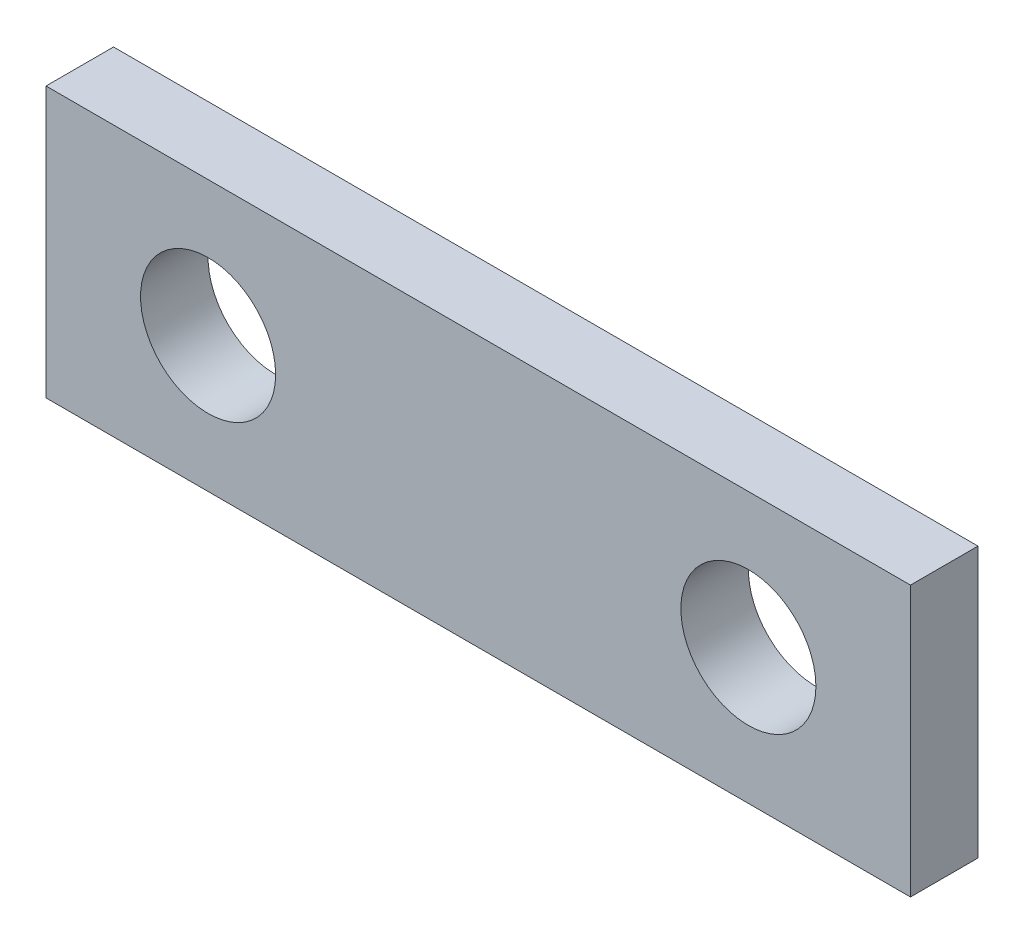
ISO-10303-21;
HEADER;
FILE_DESCRIPTION(('STEP AP214'),'2;1');
FILE_NAME('part.step','',(''),(''),'','','');
FILE_SCHEMA(('AUTOMOTIVE_DESIGN { 1 0 10303 214 1 1 1 1 }'));
ENDSEC;
DATA;
#1=APPLICATION_CONTEXT('core data for automotive mechanical design processes');
#2=APPLICATION_PROTOCOL_DEFINITION('international standard','automotive_design',2000,#1);
#3=PRODUCT_CONTEXT('',#1,'mechanical');
#4=PRODUCT('Part','Part','',(#3));
#5=PRODUCT_RELATED_PRODUCT_CATEGORY('part','',(#4));
#6=PRODUCT_DEFINITION_FORMATION('','',#4);
#7=PRODUCT_DEFINITION_CONTEXT('part definition',#1,'design');
#8=PRODUCT_DEFINITION('design','',#6,#7);
#9=PRODUCT_DEFINITION_SHAPE('','',#8);
#10=(LENGTH_UNIT() NAMED_UNIT(*) SI_UNIT(.MILLI.,.METRE.));
#11=(NAMED_UNIT(*) PLANE_ANGLE_UNIT() SI_UNIT($,.RADIAN.));
#12=(NAMED_UNIT(*) SI_UNIT($,.STERADIAN.) SOLID_ANGLE_UNIT());
#13=UNCERTAINTY_MEASURE_WITH_UNIT(LENGTH_MEASURE(1.E-05),#10,'distance_accuracy_value','');
#14=(GEOMETRIC_REPRESENTATION_CONTEXT(3) GLOBAL_UNCERTAINTY_ASSIGNED_CONTEXT((#13)) GLOBAL_UNIT_ASSIGNED_CONTEXT((#10,
#11,#12)) REPRESENTATION_CONTEXT('',''));
#15=CARTESIAN_POINT('',(0.,0.,0.));
#16=DIRECTION('',(0.,0.,1.));
#17=DIRECTION('',(1.,0.,0.));
#18=AXIS2_PLACEMENT_3D('',#15,#16,#17);
#19=CARTESIAN_POINT('',(0.,0.,1.5875));
#20=DIRECTION('',(0.,0.,-1.));
#21=DIRECTION('',(-1.,0.,0.));
#22=AXIS2_PLACEMENT_3D('',#19,#20,#21);
#23=PLANE('',#22);
#24=DIRECTION('',(0.,-1.,0.));
#25=VECTOR('',#24,1.);
#26=CARTESIAN_POINT('',(0.,0.,1.5875));
#27=LINE('',#26,#25);
#28=CARTESIAN_POINT('',(0.,6.35,1.5875));
#29=VERTEX_POINT('',#28);
#30=CARTESIAN_POINT('',(0.,0.,1.5875));
#31=VERTEX_POINT('',#30);
#32=EDGE_CURVE('E87',#29,#31,#27,.T.);
#33=ORIENTED_EDGE('',*,*,#32,.T.);
#34=DIRECTION('',(1.,0.,0.));
#35=VECTOR('',#34,1.);
#36=CARTESIAN_POINT('',(0.,0.,1.5875));
#37=LINE('',#36,#35);
#38=CARTESIAN_POINT('',(20.32,0.,1.5875));
#39=VERTEX_POINT('',#38);
#40=EDGE_CURVE('E82',#31,#39,#37,.T.);
#41=ORIENTED_EDGE('',*,*,#40,.T.);
#42=DIRECTION('',(0.,1.,0.));
#43=VECTOR('',#42,1.);
#44=CARTESIAN_POINT('',(20.32,0.,1.5875));
#45=LINE('',#44,#43);
#46=CARTESIAN_POINT('',(20.32,6.35,1.5875));
#47=VERTEX_POINT('',#46);
#48=EDGE_CURVE('E85',#39,#47,#45,.T.);
#49=ORIENTED_EDGE('',*,*,#48,.T.);
#50=DIRECTION('',(-1.,0.,0.));
#51=VECTOR('',#50,1.);
#52=CARTESIAN_POINT('',(0.,6.35,1.5875));
#53=LINE('',#52,#51);
#54=EDGE_CURVE('E52',#47,#29,#53,.T.);
#55=ORIENTED_EDGE('',*,*,#54,.T.);
#56=EDGE_LOOP('',(#33,#41,#49,#55));
#57=FACE_BOUND('',#56,.T.);
#58=CARTESIAN_POINT('',(3.81,3.175,1.5875));
#59=DIRECTION('',(0.,0.,1.));
#60=DIRECTION('',(1.,0.,0.));
#61=AXIS2_PLACEMENT_3D('',#58,#59,#60);
#62=CIRCLE('',#61,1.5875);
#63=CARTESIAN_POINT('',(5.3975,3.175,1.5875));
#64=VERTEX_POINT('',#63);
#65=EDGE_CURVE('E102',#64,#64,#62,.T.);
#66=ORIENTED_EDGE('',*,*,#65,.F.);
#67=EDGE_LOOP('',(#66));
#68=FACE_BOUND('',#67,.T.);
#69=CARTESIAN_POINT('',(16.51,3.175,1.5875));
#70=DIRECTION('',(0.,0.,1.));
#71=DIRECTION('',(1.,0.,0.));
#72=AXIS2_PLACEMENT_3D('',#69,#70,#71);
#73=CIRCLE('',#72,1.5875);
#74=CARTESIAN_POINT('',(18.0975,3.175,1.5875));
#75=VERTEX_POINT('',#74);
#76=EDGE_CURVE('E117',#75,#75,#73,.T.);
#77=ORIENTED_EDGE('',*,*,#76,.F.);
#78=EDGE_LOOP('',(#77));
#79=FACE_BOUND('',#78,.T.);
#80=ADVANCED_FACE('F35',(#57,#68,#79),#23,.F.);
#81=CARTESIAN_POINT('',(0.,0.,0.));
#82=DIRECTION('',(0.,0.,-1.));
#83=DIRECTION('',(-1.,0.,0.));
#84=AXIS2_PLACEMENT_3D('',#81,#82,#83);
#85=PLANE('',#84);
#86=CARTESIAN_POINT('',(3.81,3.175,0.));
#87=DIRECTION('',(0.,0.,1.));
#88=DIRECTION('',(1.,0.,0.));
#89=AXIS2_PLACEMENT_3D('',#86,#87,#88);
#90=CIRCLE('',#89,1.5875);
#91=CARTESIAN_POINT('',(5.3975,3.175,0.));
#92=VERTEX_POINT('',#91);
#93=EDGE_CURVE('E114',#92,#92,#90,.T.);
#94=ORIENTED_EDGE('',*,*,#93,.T.);
#95=EDGE_LOOP('',(#94));
#96=FACE_BOUND('',#95,.T.);
#97=DIRECTION('',(0.,-1.,0.));
#98=VECTOR('',#97,1.);
#99=CARTESIAN_POINT('',(0.,0.,0.));
#100=LINE('',#99,#98);
#101=CARTESIAN_POINT('',(0.,6.35,0.));
#102=VERTEX_POINT('',#101);
#103=CARTESIAN_POINT('',(0.,0.,0.));
#104=VERTEX_POINT('',#103);
#105=EDGE_CURVE('E99',#102,#104,#100,.T.);
#106=ORIENTED_EDGE('',*,*,#105,.F.);
#107=DIRECTION('',(-1.,0.,0.));
#108=VECTOR('',#107,1.);
#109=CARTESIAN_POINT('',(0.,6.35,0.));
#110=LINE('',#109,#108);
#111=CARTESIAN_POINT('',(20.32,6.35,0.));
#112=VERTEX_POINT('',#111);
#113=EDGE_CURVE('E75',#112,#102,#110,.T.);
#114=ORIENTED_EDGE('',*,*,#113,.F.);
#115=DIRECTION('',(0.,1.,0.));
#116=VECTOR('',#115,1.);
#117=CARTESIAN_POINT('',(20.32,0.,0.));
#118=LINE('',#117,#116);
#119=CARTESIAN_POINT('',(20.32,0.,0.));
#120=VERTEX_POINT('',#119);
#121=EDGE_CURVE('E69',#120,#112,#118,.T.);
#122=ORIENTED_EDGE('',*,*,#121,.F.);
#123=DIRECTION('',(1.,0.,0.));
#124=VECTOR('',#123,1.);
#125=CARTESIAN_POINT('',(0.,0.,0.));
#126=LINE('',#125,#124);
#127=EDGE_CURVE('E91',#104,#120,#126,.T.);
#128=ORIENTED_EDGE('',*,*,#127,.F.);
#129=EDGE_LOOP('',(#106,#114,#122,#128));
#130=FACE_BOUND('',#129,.T.);
#131=CARTESIAN_POINT('',(16.51,3.175,0.));
#132=DIRECTION('',(0.,0.,1.));
#133=DIRECTION('',(1.,0.,0.));
#134=AXIS2_PLACEMENT_3D('',#131,#132,#133);
#135=CIRCLE('',#134,1.5875);
#136=CARTESIAN_POINT('',(18.0975,3.175,0.));
#137=VERTEX_POINT('',#136);
#138=EDGE_CURVE('E120',#137,#137,#135,.T.);
#139=ORIENTED_EDGE('',*,*,#138,.T.);
#140=EDGE_LOOP('',(#139));
#141=FACE_BOUND('',#140,.T.);
#142=ADVANCED_FACE('F110',(#96,#130,#141),#85,.T.);
#143=CARTESIAN_POINT('',(0.,0.,1.5875));
#144=DIRECTION('',(1.,0.,0.));
#145=DIRECTION('',(0.,0.,-1.));
#146=AXIS2_PLACEMENT_3D('',#143,#144,#145);
#147=PLANE('',#146);
#148=ORIENTED_EDGE('',*,*,#105,.T.);
#149=DIRECTION('',(0.,0.,-1.));
#150=VECTOR('',#149,1.);
#151=CARTESIAN_POINT('',(0.,0.,1.5875));
#152=LINE('',#151,#150);
#153=EDGE_CURVE('E11',#31,#104,#152,.T.);
#154=ORIENTED_EDGE('',*,*,#153,.F.);
#155=ORIENTED_EDGE('',*,*,#32,.F.);
#156=DIRECTION('',(0.,0.,-1.));
#157=VECTOR('',#156,1.);
#158=CARTESIAN_POINT('',(0.,6.35,1.5875));
#159=LINE('',#158,#157);
#160=EDGE_CURVE('E95',#29,#102,#159,.T.);
#161=ORIENTED_EDGE('',*,*,#160,.T.);
#162=EDGE_LOOP('',(#148,#154,#155,#161));
#163=FACE_BOUND('',#162,.T.);
#164=ADVANCED_FACE('F37',(#163),#147,.F.);
#165=CARTESIAN_POINT('',(0.,0.,1.5875));
#166=DIRECTION('',(0.,1.,0.));
#167=DIRECTION('',(0.,0.,1.));
#168=AXIS2_PLACEMENT_3D('',#165,#166,#167);
#169=PLANE('',#168);
#170=ORIENTED_EDGE('',*,*,#127,.T.);
#171=DIRECTION('',(0.,0.,-1.));
#172=VECTOR('',#171,1.);
#173=CARTESIAN_POINT('',(20.32,0.,1.5875));
#174=LINE('',#173,#172);
#175=EDGE_CURVE('E44',#39,#120,#174,.T.);
#176=ORIENTED_EDGE('',*,*,#175,.F.);
#177=ORIENTED_EDGE('',*,*,#40,.F.);
#178=ORIENTED_EDGE('',*,*,#153,.T.);
#179=EDGE_LOOP('',(#170,#176,#177,#178));
#180=FACE_BOUND('',#179,.T.);
#181=ADVANCED_FACE('F90',(#180),#169,.F.);
#182=CARTESIAN_POINT('',(20.32,0.,1.5875));
#183=DIRECTION('',(-1.,0.,0.));
#184=DIRECTION('',(0.,0.,1.));
#185=AXIS2_PLACEMENT_3D('',#182,#183,#184);
#186=PLANE('',#185);
#187=ORIENTED_EDGE('',*,*,#121,.T.);
#188=DIRECTION('',(0.,0.,-1.));
#189=VECTOR('',#188,1.);
#190=CARTESIAN_POINT('',(20.32,6.35,1.5875));
#191=LINE('',#190,#189);
#192=EDGE_CURVE('E92',#47,#112,#191,.T.);
#193=ORIENTED_EDGE('',*,*,#192,.F.);
#194=ORIENTED_EDGE('',*,*,#48,.F.);
#195=ORIENTED_EDGE('',*,*,#175,.T.);
#196=EDGE_LOOP('',(#187,#193,#194,#195));
#197=FACE_BOUND('',#196,.T.);
#198=ADVANCED_FACE('F93',(#197),#186,.F.);
#199=CARTESIAN_POINT('',(0.,6.35,1.5875));
#200=DIRECTION('',(0.,-1.,0.));
#201=DIRECTION('',(0.,0.,-1.));
#202=AXIS2_PLACEMENT_3D('',#199,#200,#201);
#203=PLANE('',#202);
#204=ORIENTED_EDGE('',*,*,#113,.T.);
#205=ORIENTED_EDGE('',*,*,#160,.F.);
#206=ORIENTED_EDGE('',*,*,#54,.F.);
#207=ORIENTED_EDGE('',*,*,#192,.T.);
#208=EDGE_LOOP('',(#204,#205,#206,#207));
#209=FACE_BOUND('',#208,.T.);
#210=ADVANCED_FACE('F107',(#209),#203,.F.);
#211=CARTESIAN_POINT('',(3.81,3.175,1.5875));
#212=DIRECTION('',(0.,0.,-1.));
#213=DIRECTION('',(-1.,0.,0.));
#214=AXIS2_PLACEMENT_3D('',#211,#212,#213);
#215=CYLINDRICAL_SURFACE('',#214,1.5875);
#216=ORIENTED_EDGE('',*,*,#65,.T.);
#217=EDGE_LOOP('',(#216));
#218=FACE_BOUND('',#217,.T.);
#219=ORIENTED_EDGE('',*,*,#93,.F.);
#220=EDGE_LOOP('',(#219));
#221=FACE_BOUND('',#220,.T.);
#222=ADVANCED_FACE('F137',(#218,#221),#215,.F.);
#223=CARTESIAN_POINT('',(16.51,3.175,1.5875));
#224=DIRECTION('',(0.,0.,-1.));
#225=DIRECTION('',(-1.,0.,0.));
#226=AXIS2_PLACEMENT_3D('',#223,#224,#225);
#227=CYLINDRICAL_SURFACE('',#226,1.5875);
#228=ORIENTED_EDGE('',*,*,#76,.T.);
#229=EDGE_LOOP('',(#228));
#230=FACE_BOUND('',#229,.T.);
#231=ORIENTED_EDGE('',*,*,#138,.F.);
#232=EDGE_LOOP('',(#231));
#233=FACE_BOUND('',#232,.T.);
#234=ADVANCED_FACE('F126',(#230,#233),#227,.F.);
#235=CLOSED_SHELL('',(#80,#142,#164,#181,#198,#210,#222,#234));
#236=MANIFOLD_SOLID_BREP('B2',#235);
#237=ADVANCED_BREP_SHAPE_REPRESENTATION('',(#18,#236),#14);
#238=SHAPE_DEFINITION_REPRESENTATION(#9,#237);
ENDSEC;
END-ISO-10303-21;
